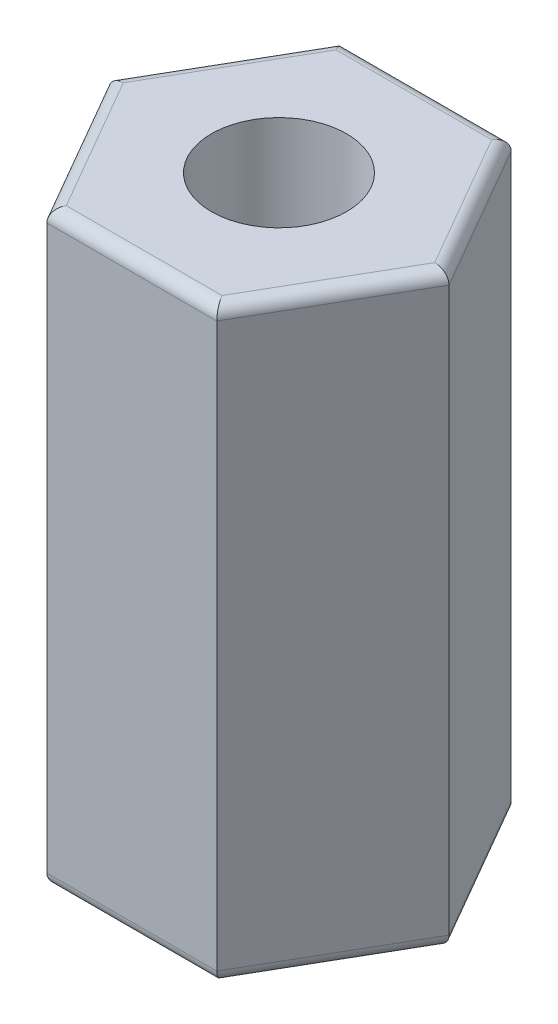
ISO-10303-21;
HEADER;
FILE_DESCRIPTION(('STEP AP214'),'2;1');
FILE_NAME('part.step','',(''),(''),'','','');
FILE_SCHEMA(('AUTOMOTIVE_DESIGN { 1 0 10303 214 1 1 1 1 }'));
ENDSEC;
DATA;
#1=APPLICATION_CONTEXT('core data for automotive mechanical design processes');
#2=APPLICATION_PROTOCOL_DEFINITION('international standard','automotive_design',2000,#1);
#3=PRODUCT_CONTEXT('',#1,'mechanical');
#4=PRODUCT('Part','Part','',(#3));
#5=PRODUCT_RELATED_PRODUCT_CATEGORY('part','',(#4));
#6=PRODUCT_DEFINITION_FORMATION('','',#4);
#7=PRODUCT_DEFINITION_CONTEXT('part definition',#1,'design');
#8=PRODUCT_DEFINITION('design','',#6,#7);
#9=PRODUCT_DEFINITION_SHAPE('','',#8);
#10=(LENGTH_UNIT() NAMED_UNIT(*) SI_UNIT(.MILLI.,.METRE.));
#11=(NAMED_UNIT(*) PLANE_ANGLE_UNIT() SI_UNIT($,.RADIAN.));
#12=(NAMED_UNIT(*) SI_UNIT($,.STERADIAN.) SOLID_ANGLE_UNIT());
#13=UNCERTAINTY_MEASURE_WITH_UNIT(LENGTH_MEASURE(1.E-05),#10,'distance_accuracy_value','');
#14=(GEOMETRIC_REPRESENTATION_CONTEXT(3) GLOBAL_UNCERTAINTY_ASSIGNED_CONTEXT((#13)) GLOBAL_UNIT_ASSIGNED_CONTEXT((#10,
#11,#12)) REPRESENTATION_CONTEXT('',''));
#15=CARTESIAN_POINT('',(0.,0.,0.));
#16=DIRECTION('',(0.,0.,1.));
#17=DIRECTION('',(1.,0.,0.));
#18=AXIS2_PLACEMENT_3D('',#15,#16,#17);
#19=CARTESIAN_POINT('',(1.37409364067131,9.5,2.38));
#20=DIRECTION('',(-0.866025403784439,0.,-0.5));
#21=DIRECTION('',(-0.5,0.,0.866025403784439));
#22=AXIS2_PLACEMENT_3D('',#19,#20,#21);
#23=PLANE('',#22);
#24=DIRECTION('',(0.,-1.,0.));
#25=VECTOR('',#24,1.);
#26=CARTESIAN_POINT('',(2.74818728134262,9.5,0.));
#27=LINE('',#26,#25);
#28=CARTESIAN_POINT('',(2.74818728134262,9.3,0.));
#29=VERTEX_POINT('',#28);
#30=CARTESIAN_POINT('',(2.74818728134262,0.200000000000001,0.));
#31=VERTEX_POINT('',#30);
#32=EDGE_CURVE('E147',#29,#31,#27,.T.);
#33=ORIENTED_EDGE('',*,*,#32,.F.);
#34=DIRECTION('',(0.5,0.,-0.866025403784439));
#35=VECTOR('',#34,1.);
#36=CARTESIAN_POINT('',(1.37409364067131,9.3,2.38));
#37=LINE('',#36,#35);
#38=CARTESIAN_POINT('',(1.37409364067131,9.3,2.38));
#39=VERTEX_POINT('',#38);
#40=EDGE_CURVE('E138',#29,#39,#37,.F.);
#41=ORIENTED_EDGE('',*,*,#40,.T.);
#42=DIRECTION('',(0.,-1.,0.));
#43=VECTOR('',#42,1.);
#44=CARTESIAN_POINT('',(1.37409364067131,9.5,2.38));
#45=LINE('',#44,#43);
#46=CARTESIAN_POINT('',(1.37409364067131,0.200000000000001,2.38));
#47=VERTEX_POINT('',#46);
#48=EDGE_CURVE('E204',#39,#47,#45,.T.);
#49=ORIENTED_EDGE('',*,*,#48,.T.);
#50=DIRECTION('',(0.5,0.,-0.866025403784439));
#51=VECTOR('',#50,1.);
#52=CARTESIAN_POINT('',(1.37409364067131,0.200000000000001,2.38));
#53=LINE('',#52,#51);
#54=EDGE_CURVE('E179',#47,#31,#53,.T.);
#55=ORIENTED_EDGE('',*,*,#54,.T.);
#56=EDGE_LOOP('',(#33,#41,#49,#55));
#57=FACE_BOUND('',#56,.T.);
#58=ADVANCED_FACE('F31',(#57),#23,.F.);
#59=CARTESIAN_POINT('',(2.74818728134262,9.5,0.));
#60=DIRECTION('',(-0.866025403784439,0.,0.5));
#61=DIRECTION('',(0.5,0.,0.866025403784439));
#62=AXIS2_PLACEMENT_3D('',#59,#60,#61);
#63=PLANE('',#62);
#64=DIRECTION('',(0.,-1.,0.));
#65=VECTOR('',#64,1.);
#66=CARTESIAN_POINT('',(1.37409364067131,9.5,-2.38));
#67=LINE('',#66,#65);
#68=CARTESIAN_POINT('',(1.37409364067131,9.3,-2.38));
#69=VERTEX_POINT('',#68);
#70=CARTESIAN_POINT('',(1.37409364067131,0.200000000000001,-2.38));
#71=VERTEX_POINT('',#70);
#72=EDGE_CURVE('E150',#69,#71,#67,.T.);
#73=ORIENTED_EDGE('',*,*,#72,.F.);
#74=DIRECTION('',(-0.5,0.,-0.866025403784439));
#75=VECTOR('',#74,1.);
#76=CARTESIAN_POINT('',(2.74818728134262,9.3,0.));
#77=LINE('',#76,#75);
#78=EDGE_CURVE('E184',#69,#29,#77,.F.);
#79=ORIENTED_EDGE('',*,*,#78,.T.);
#80=ORIENTED_EDGE('',*,*,#32,.T.);
#81=DIRECTION('',(-0.5,0.,-0.866025403784439));
#82=VECTOR('',#81,1.);
#83=CARTESIAN_POINT('',(2.74818728134262,0.200000000000001,0.));
#84=LINE('',#83,#82);
#85=EDGE_CURVE('E182',#31,#71,#84,.T.);
#86=ORIENTED_EDGE('',*,*,#85,.T.);
#87=EDGE_LOOP('',(#73,#79,#80,#86));
#88=FACE_BOUND('',#87,.T.);
#89=ADVANCED_FACE('F265',(#88),#63,.F.);
#90=CARTESIAN_POINT('',(1.37409364067131,9.5,-2.38));
#91=DIRECTION('',(0.,0.,1.));
#92=DIRECTION('',(1.,0.,0.));
#93=AXIS2_PLACEMENT_3D('',#90,#91,#92);
#94=PLANE('',#93);
#95=DIRECTION('',(0.,-1.,0.));
#96=VECTOR('',#95,1.);
#97=CARTESIAN_POINT('',(-1.37409364067131,9.5,-2.38));
#98=LINE('',#97,#96);
#99=CARTESIAN_POINT('',(-1.37409364067131,9.3,-2.38));
#100=VERTEX_POINT('',#99);
#101=CARTESIAN_POINT('',(-1.37409364067131,0.200000000000001,-2.38));
#102=VERTEX_POINT('',#101);
#103=EDGE_CURVE('E256',#100,#102,#98,.T.);
#104=ORIENTED_EDGE('',*,*,#103,.F.);
#105=DIRECTION('',(-1.,0.,0.));
#106=VECTOR('',#105,1.);
#107=CARTESIAN_POINT('',(1.37409364067131,9.3,-2.38));
#108=LINE('',#107,#106);
#109=EDGE_CURVE('E163',#100,#69,#108,.F.);
#110=ORIENTED_EDGE('',*,*,#109,.T.);
#111=ORIENTED_EDGE('',*,*,#72,.T.);
#112=DIRECTION('',(-1.,0.,0.));
#113=VECTOR('',#112,1.);
#114=CARTESIAN_POINT('',(1.37409364067131,0.200000000000001,-2.38));
#115=LINE('',#114,#113);
#116=EDGE_CURVE('E161',#71,#102,#115,.T.);
#117=ORIENTED_EDGE('',*,*,#116,.T.);
#118=EDGE_LOOP('',(#104,#110,#111,#117));
#119=FACE_BOUND('',#118,.T.);
#120=ADVANCED_FACE('F262',(#119),#94,.F.);
#121=CARTESIAN_POINT('',(-1.37409364067131,9.5,-2.38));
#122=DIRECTION('',(0.866025403784439,0.,0.5));
#123=DIRECTION('',(0.5,0.,-0.866025403784439));
#124=AXIS2_PLACEMENT_3D('',#121,#122,#123);
#125=PLANE('',#124);
#126=DIRECTION('',(0.,-1.,0.));
#127=VECTOR('',#126,1.);
#128=CARTESIAN_POINT('',(-2.74818728134262,9.5,0.));
#129=LINE('',#128,#127);
#130=CARTESIAN_POINT('',(-2.74818728134262,9.3,0.));
#131=VERTEX_POINT('',#130);
#132=CARTESIAN_POINT('',(-2.74818728134262,0.200000000000001,0.));
#133=VERTEX_POINT('',#132);
#134=EDGE_CURVE('E249',#131,#133,#129,.T.);
#135=ORIENTED_EDGE('',*,*,#134,.F.);
#136=DIRECTION('',(-0.5,0.,0.866025403784439));
#137=VECTOR('',#136,1.);
#138=CARTESIAN_POINT('',(-1.37409364067131,9.3,-2.38));
#139=LINE('',#138,#137);
#140=EDGE_CURVE('E168',#131,#100,#139,.F.);
#141=ORIENTED_EDGE('',*,*,#140,.T.);
#142=ORIENTED_EDGE('',*,*,#103,.T.);
#143=DIRECTION('',(-0.5,0.,0.866025403784439));
#144=VECTOR('',#143,1.);
#145=CARTESIAN_POINT('',(-1.37409364067131,0.200000000000001,-2.38));
#146=LINE('',#145,#144);
#147=EDGE_CURVE('E166',#102,#133,#146,.T.);
#148=ORIENTED_EDGE('',*,*,#147,.T.);
#149=EDGE_LOOP('',(#135,#141,#142,#148));
#150=FACE_BOUND('',#149,.T.);
#151=ADVANCED_FACE('F272',(#150),#125,.F.);
#152=CARTESIAN_POINT('',(-2.74818728134262,9.5,0.));
#153=DIRECTION('',(0.866025403784439,0.,-0.5));
#154=DIRECTION('',(-0.5,0.,-0.866025403784439));
#155=AXIS2_PLACEMENT_3D('',#152,#153,#154);
#156=PLANE('',#155);
#157=DIRECTION('',(0.,-1.,0.));
#158=VECTOR('',#157,1.);
#159=CARTESIAN_POINT('',(-1.37409364067131,9.5,2.38));
#160=LINE('',#159,#158);
#161=CARTESIAN_POINT('',(-1.37409364067131,9.3,2.38));
#162=VERTEX_POINT('',#161);
#163=CARTESIAN_POINT('',(-1.37409364067131,0.200000000000001,2.38));
#164=VERTEX_POINT('',#163);
#165=EDGE_CURVE('E245',#162,#164,#160,.T.);
#166=ORIENTED_EDGE('',*,*,#165,.F.);
#167=DIRECTION('',(0.5,0.,0.866025403784439));
#168=VECTOR('',#167,1.);
#169=CARTESIAN_POINT('',(-2.74818728134262,9.3,0.));
#170=LINE('',#169,#168);
#171=EDGE_CURVE('E172',#162,#131,#170,.F.);
#172=ORIENTED_EDGE('',*,*,#171,.T.);
#173=ORIENTED_EDGE('',*,*,#134,.T.);
#174=DIRECTION('',(0.5,0.,0.866025403784439));
#175=VECTOR('',#174,1.);
#176=CARTESIAN_POINT('',(-2.74818728134262,0.200000000000001,0.));
#177=LINE('',#176,#175);
#178=EDGE_CURVE('E170',#133,#164,#177,.T.);
#179=ORIENTED_EDGE('',*,*,#178,.T.);
#180=EDGE_LOOP('',(#166,#172,#173,#179));
#181=FACE_BOUND('',#180,.T.);
#182=ADVANCED_FACE('F359',(#181),#156,.F.);
#183=CARTESIAN_POINT('',(-1.37409364067131,9.5,2.38));
#184=DIRECTION('',(0.,0.,-1.));
#185=DIRECTION('',(-1.,0.,0.));
#186=AXIS2_PLACEMENT_3D('',#183,#184,#185);
#187=PLANE('',#186);
#188=ORIENTED_EDGE('',*,*,#48,.F.);
#189=DIRECTION('',(1.,0.,0.));
#190=VECTOR('',#189,1.);
#191=CARTESIAN_POINT('',(-1.37409364067131,9.3,2.38));
#192=LINE('',#191,#190);
#193=EDGE_CURVE('E177',#39,#162,#192,.F.);
#194=ORIENTED_EDGE('',*,*,#193,.T.);
#195=ORIENTED_EDGE('',*,*,#165,.T.);
#196=DIRECTION('',(1.,0.,0.));
#197=VECTOR('',#196,1.);
#198=CARTESIAN_POINT('',(-1.37409364067131,0.200000000000001,2.38));
#199=LINE('',#198,#197);
#200=EDGE_CURVE('E174',#164,#47,#199,.T.);
#201=ORIENTED_EDGE('',*,*,#200,.T.);
#202=EDGE_LOOP('',(#188,#194,#195,#201));
#203=FACE_BOUND('',#202,.T.);
#204=ADVANCED_FACE('F242',(#203),#187,.F.);
#205=CARTESIAN_POINT('',(2.74818728134262,9.5,0.));
#206=DIRECTION('',(0.,1.,0.));
#207=DIRECTION('',(0.,0.,1.));
#208=AXIS2_PLACEMENT_3D('',#205,#206,#207);
#209=PLANE('',#208);
#210=CARTESIAN_POINT('',(0.,9.5,0.));
#211=DIRECTION('',(0.,1.,0.));
#212=DIRECTION('',(0.,0.,1.));
#213=AXIS2_PLACEMENT_3D('',#210,#211,#212);
#214=CIRCLE('',#213,1.0922);
#215=CARTESIAN_POINT('',(0.,9.5,1.0922));
#216=VERTEX_POINT('',#215);
#217=EDGE_CURVE('E207',#216,#216,#214,.T.);
#218=ORIENTED_EDGE('',*,*,#217,.F.);
#219=EDGE_LOOP('',(#218));
#220=FACE_BOUND('',#219,.T.);
#221=DIRECTION('',(-0.5,0.,-0.866025403784439));
#222=VECTOR('',#221,1.);
#223=CARTESIAN_POINT('',(1.20088855991442,9.5,-2.28));
#224=LINE('',#223,#222);
#225=CARTESIAN_POINT('',(2.51724717366677,9.5,0.));
#226=VERTEX_POINT('',#225);
#227=CARTESIAN_POINT('',(1.25862358683338,9.5,-2.18));
#228=VERTEX_POINT('',#227);
#229=EDGE_CURVE('E126',#226,#228,#224,.T.);
#230=ORIENTED_EDGE('',*,*,#229,.T.);
#231=DIRECTION('',(-1.,0.,0.));
#232=VECTOR('',#231,1.);
#233=CARTESIAN_POINT('',(-1.37409364067131,9.5,-2.18));
#234=LINE('',#233,#232);
#235=CARTESIAN_POINT('',(-1.25862358683338,9.5,-2.18));
#236=VERTEX_POINT('',#235);
#237=EDGE_CURVE('E159',#228,#236,#234,.T.);
#238=ORIENTED_EDGE('',*,*,#237,.T.);
#239=DIRECTION('',(-0.5,0.,0.866025403784439));
#240=VECTOR('',#239,1.);
#241=CARTESIAN_POINT('',(-2.57498220058573,9.5,0.100000000000001));
#242=LINE('',#241,#240);
#243=CARTESIAN_POINT('',(-2.51724717366677,9.5,0.));
#244=VERTEX_POINT('',#243);
#245=EDGE_CURVE('E157',#236,#244,#242,.T.);
#246=ORIENTED_EDGE('',*,*,#245,.T.);
#247=DIRECTION('',(0.5,0.,0.866025403784439));
#248=VECTOR('',#247,1.);
#249=CARTESIAN_POINT('',(-1.20088855991442,9.5,2.28));
#250=LINE('',#249,#248);
#251=CARTESIAN_POINT('',(-1.25862358683339,9.5,2.18));
#252=VERTEX_POINT('',#251);
#253=EDGE_CURVE('E155',#244,#252,#250,.T.);
#254=ORIENTED_EDGE('',*,*,#253,.T.);
#255=DIRECTION('',(1.,0.,0.));
#256=VECTOR('',#255,1.);
#257=CARTESIAN_POINT('',(1.37409364067131,9.5,2.18));
#258=LINE('',#257,#256);
#259=CARTESIAN_POINT('',(1.25862358683338,9.5,2.18));
#260=VERTEX_POINT('',#259);
#261=EDGE_CURVE('E129',#252,#260,#258,.T.);
#262=ORIENTED_EDGE('',*,*,#261,.T.);
#263=DIRECTION('',(0.5,0.,-0.866025403784439));
#264=VECTOR('',#263,1.);
#265=CARTESIAN_POINT('',(2.57498220058573,9.5,-0.1));
#266=LINE('',#265,#264);
#267=EDGE_CURVE('E121',#260,#226,#266,.T.);
#268=ORIENTED_EDGE('',*,*,#267,.T.);
#269=EDGE_LOOP('',(#230,#238,#246,#254,#262,#268));
#270=FACE_BOUND('',#269,.T.);
#271=ADVANCED_FACE('F123',(#220,#270),#209,.T.);
#272=CARTESIAN_POINT('',(2.74818728134262,0.,0.));
#273=DIRECTION('',(0.,1.,0.));
#274=DIRECTION('',(0.,0.,1.));
#275=AXIS2_PLACEMENT_3D('',#272,#273,#274);
#276=PLANE('',#275);
#277=CARTESIAN_POINT('',(0.,0.,0.));
#278=DIRECTION('',(0.,-1.,0.));
#279=DIRECTION('',(0.,0.,-1.));
#280=AXIS2_PLACEMENT_3D('',#277,#278,#279);
#281=CIRCLE('',#280,1.0922);
#282=CARTESIAN_POINT('',(0.,0.,-1.0922));
#283=VERTEX_POINT('',#282);
#284=EDGE_CURVE('E458',#283,#283,#281,.T.);
#285=ORIENTED_EDGE('',*,*,#284,.F.);
#286=EDGE_LOOP('',(#285));
#287=FACE_BOUND('',#286,.T.);
#288=DIRECTION('',(0.5,0.,-0.866025403784439));
#289=VECTOR('',#288,1.);
#290=CARTESIAN_POINT('',(2.57498220058573,0.,-0.1));
#291=LINE('',#290,#289);
#292=CARTESIAN_POINT('',(2.51724717366677,0.,0.));
#293=VERTEX_POINT('',#292);
#294=CARTESIAN_POINT('',(1.25862358683338,0.,2.18));
#295=VERTEX_POINT('',#294);
#296=EDGE_CURVE('E186',#293,#295,#291,.F.);
#297=ORIENTED_EDGE('',*,*,#296,.T.);
#298=DIRECTION('',(1.,0.,0.));
#299=VECTOR('',#298,1.);
#300=CARTESIAN_POINT('',(2.74818728134262,0.,2.18));
#301=LINE('',#300,#299);
#302=CARTESIAN_POINT('',(-1.25862358683339,0.,2.18));
#303=VERTEX_POINT('',#302);
#304=EDGE_CURVE('E11',#295,#303,#301,.F.);
#305=ORIENTED_EDGE('',*,*,#304,.T.);
#306=DIRECTION('',(0.5,0.,0.866025403784439));
#307=VECTOR('',#306,1.);
#308=CARTESIAN_POINT('',(-1.20088855991442,0.,2.28));
#309=LINE('',#308,#307);
#310=CARTESIAN_POINT('',(-2.51724717366677,0.,0.));
#311=VERTEX_POINT('',#310);
#312=EDGE_CURVE('E40',#303,#311,#309,.F.);
#313=ORIENTED_EDGE('',*,*,#312,.T.);
#314=DIRECTION('',(-0.5,0.,0.866025403784439));
#315=VECTOR('',#314,1.);
#316=CARTESIAN_POINT('',(-1.20088855991442,0.,-2.28));
#317=LINE('',#316,#315);
#318=CARTESIAN_POINT('',(-1.25862358683338,0.,-2.18));
#319=VERTEX_POINT('',#318);
#320=EDGE_CURVE('E192',#311,#319,#317,.F.);
#321=ORIENTED_EDGE('',*,*,#320,.T.);
#322=DIRECTION('',(-1.,0.,0.));
#323=VECTOR('',#322,1.);
#324=CARTESIAN_POINT('',(2.74818728134262,0.,-2.18));
#325=LINE('',#324,#323);
#326=CARTESIAN_POINT('',(1.25862358683338,0.,-2.18));
#327=VERTEX_POINT('',#326);
#328=EDGE_CURVE('E190',#319,#327,#325,.F.);
#329=ORIENTED_EDGE('',*,*,#328,.T.);
#330=DIRECTION('',(-0.5,0.,-0.866025403784439));
#331=VECTOR('',#330,1.);
#332=CARTESIAN_POINT('',(2.57498220058573,0.,0.1));
#333=LINE('',#332,#331);
#334=EDGE_CURVE('E188',#327,#293,#333,.F.);
#335=ORIENTED_EDGE('',*,*,#334,.T.);
#336=EDGE_LOOP('',(#297,#305,#313,#321,#329,#335));
#337=FACE_BOUND('',#336,.T.);
#338=ADVANCED_FACE('F229',(#287,#337),#276,.F.);
#339=CARTESIAN_POINT('',(2.74818728134262,9.3,2.18));
#340=DIRECTION('',(-1.,0.,0.));
#341=DIRECTION('',(0.,0.,1.));
#342=AXIS2_PLACEMENT_3D('',#339,#340,#341);
#343=CYLINDRICAL_SURFACE('',#342,0.2);
#344=CARTESIAN_POINT('',(-1.25862358683339,9.3,2.18));
#345=DIRECTION('',(-0.866025403784439,0.,-0.5));
#346=DIRECTION('',(-0.5,0.,0.866025403784439));
#347=AXIS2_PLACEMENT_3D('',#344,#345,#346);
#348=ELLIPSE('',#347,0.23094010767585,0.2);
#349=EDGE_CURVE('E141',#162,#252,#348,.T.);
#350=ORIENTED_EDGE('',*,*,#349,.F.);
#351=ORIENTED_EDGE('',*,*,#193,.F.);
#352=CARTESIAN_POINT('',(1.25862358683338,9.3,2.18));
#353=DIRECTION('',(-0.866025403784438,0.,0.5));
#354=DIRECTION('',(0.5,0.,0.866025403784439));
#355=AXIS2_PLACEMENT_3D('',#352,#353,#354);
#356=ELLIPSE('',#355,0.23094010767585,0.2);
#357=EDGE_CURVE('E202',#260,#39,#356,.F.);
#358=ORIENTED_EDGE('',*,*,#357,.F.);
#359=ORIENTED_EDGE('',*,*,#261,.F.);
#360=EDGE_LOOP('',(#350,#351,#358,#359));
#361=FACE_BOUND('',#360,.T.);
#362=ADVANCED_FACE('F293',(#361),#343,.T.);
#363=CARTESIAN_POINT('',(2.57498220058573,9.3,-0.1));
#364=DIRECTION('',(-0.5,0.,0.866025403784439));
#365=DIRECTION('',(0.866025403784439,0.,0.5));
#366=AXIS2_PLACEMENT_3D('',#363,#364,#365);
#367=CYLINDRICAL_SURFACE('',#366,0.2);
#368=ORIENTED_EDGE('',*,*,#357,.T.);
#369=ORIENTED_EDGE('',*,*,#40,.F.);
#370=CARTESIAN_POINT('',(2.51724717366677,9.3,0.));
#371=DIRECTION('',(0.,0.,1.));
#372=DIRECTION('',(1.,0.,0.));
#373=AXIS2_PLACEMENT_3D('',#370,#371,#372);
#374=ELLIPSE('',#373,0.23094010767585,0.2);
#375=EDGE_CURVE('E136',#226,#29,#374,.F.);
#376=ORIENTED_EDGE('',*,*,#375,.F.);
#377=ORIENTED_EDGE('',*,*,#267,.F.);
#378=EDGE_LOOP('',(#368,#369,#376,#377));
#379=FACE_BOUND('',#378,.T.);
#380=ADVANCED_FACE('F137',(#379),#367,.T.);
#381=CARTESIAN_POINT('',(-1.20088855991442,9.3,2.28));
#382=DIRECTION('',(-0.5,0.,-0.866025403784439));
#383=DIRECTION('',(-0.866025403784439,0.,0.5));
#384=AXIS2_PLACEMENT_3D('',#381,#382,#383);
#385=CYLINDRICAL_SURFACE('',#384,0.2);
#386=ORIENTED_EDGE('',*,*,#349,.T.);
#387=ORIENTED_EDGE('',*,*,#253,.F.);
#388=CARTESIAN_POINT('',(-2.51724717366677,9.3,0.));
#389=DIRECTION('',(0.,0.,-1.));
#390=DIRECTION('',(-1.,0.,0.));
#391=AXIS2_PLACEMENT_3D('',#388,#389,#390);
#392=ELLIPSE('',#391,0.23094010767585,0.2);
#393=EDGE_CURVE('E142',#131,#244,#392,.T.);
#394=ORIENTED_EDGE('',*,*,#393,.F.);
#395=ORIENTED_EDGE('',*,*,#171,.F.);
#396=EDGE_LOOP('',(#386,#387,#394,#395));
#397=FACE_BOUND('',#396,.T.);
#398=ADVANCED_FACE('F287',(#397),#385,.T.);
#399=CARTESIAN_POINT('',(2.57498220058573,9.3,0.1));
#400=DIRECTION('',(0.5,0.,0.866025403784439));
#401=DIRECTION('',(0.866025403784439,0.,-0.5));
#402=AXIS2_PLACEMENT_3D('',#399,#400,#401);
#403=CYLINDRICAL_SURFACE('',#402,0.2);
#404=ORIENTED_EDGE('',*,*,#375,.T.);
#405=ORIENTED_EDGE('',*,*,#78,.F.);
#406=CARTESIAN_POINT('',(1.25862358683338,9.3,-2.18));
#407=DIRECTION('',(0.866025403784439,0.,0.5));
#408=DIRECTION('',(-0.5,0.,0.866025403784439));
#409=AXIS2_PLACEMENT_3D('',#406,#407,#408);
#410=ELLIPSE('',#409,0.23094010767585,0.2);
#411=EDGE_CURVE('E145',#228,#69,#410,.F.);
#412=ORIENTED_EDGE('',*,*,#411,.F.);
#413=ORIENTED_EDGE('',*,*,#229,.F.);
#414=EDGE_LOOP('',(#404,#405,#412,#413));
#415=FACE_BOUND('',#414,.T.);
#416=ADVANCED_FACE('F144',(#415),#403,.T.);
#417=CARTESIAN_POINT('',(-1.20088855991442,9.3,-2.28));
#418=DIRECTION('',(0.5,0.,-0.866025403784439));
#419=DIRECTION('',(-0.866025403784439,0.,-0.5));
#420=AXIS2_PLACEMENT_3D('',#417,#418,#419);
#421=CYLINDRICAL_SURFACE('',#420,0.2);
#422=ORIENTED_EDGE('',*,*,#393,.T.);
#423=ORIENTED_EDGE('',*,*,#245,.F.);
#424=CARTESIAN_POINT('',(-1.25862358683338,9.3,-2.18));
#425=DIRECTION('',(0.866025403784439,0.,-0.5));
#426=DIRECTION('',(-0.5,0.,-0.866025403784438));
#427=AXIS2_PLACEMENT_3D('',#424,#425,#426);
#428=ELLIPSE('',#427,0.23094010767585,0.2);
#429=EDGE_CURVE('E195',#100,#236,#428,.T.);
#430=ORIENTED_EDGE('',*,*,#429,.F.);
#431=ORIENTED_EDGE('',*,*,#140,.F.);
#432=EDGE_LOOP('',(#422,#423,#430,#431));
#433=FACE_BOUND('',#432,.T.);
#434=ADVANCED_FACE('F280',(#433),#421,.T.);
#435=CARTESIAN_POINT('',(2.74818728134262,9.3,-2.18));
#436=DIRECTION('',(1.,0.,0.));
#437=DIRECTION('',(0.,0.,-1.));
#438=AXIS2_PLACEMENT_3D('',#435,#436,#437);
#439=CYLINDRICAL_SURFACE('',#438,0.2);
#440=ORIENTED_EDGE('',*,*,#411,.T.);
#441=ORIENTED_EDGE('',*,*,#109,.F.);
#442=ORIENTED_EDGE('',*,*,#429,.T.);
#443=ORIENTED_EDGE('',*,*,#237,.F.);
#444=EDGE_LOOP('',(#440,#441,#442,#443));
#445=FACE_BOUND('',#444,.T.);
#446=ADVANCED_FACE('F277',(#445),#439,.T.);
#447=CARTESIAN_POINT('',(1.37409364067131,0.200000000000001,-2.18));
#448=DIRECTION('',(-1.,0.,0.));
#449=DIRECTION('',(0.,0.,1.));
#450=AXIS2_PLACEMENT_3D('',#447,#448,#449);
#451=CYLINDRICAL_SURFACE('',#450,0.2);
#452=CARTESIAN_POINT('',(1.25862358683338,0.200000000000001,-2.18));
#453=DIRECTION('',(-0.866025403784439,0.,-0.5));
#454=DIRECTION('',(0.5,0.,-0.866025403784439));
#455=AXIS2_PLACEMENT_3D('',#452,#453,#454);
#456=ELLIPSE('',#455,0.23094010767585,0.2);
#457=EDGE_CURVE('E214',#327,#71,#456,.F.);
#458=ORIENTED_EDGE('',*,*,#457,.F.);
#459=ORIENTED_EDGE('',*,*,#328,.F.);
#460=CARTESIAN_POINT('',(-1.25862358683338,0.200000000000001,-2.18));
#461=DIRECTION('',(-0.866025403784439,0.,0.5));
#462=DIRECTION('',(-0.5,0.,-0.866025403784438));
#463=AXIS2_PLACEMENT_3D('',#460,#461,#462);
#464=ELLIPSE('',#463,0.23094010767585,0.2);
#465=EDGE_CURVE('E35',#102,#319,#464,.T.);
#466=ORIENTED_EDGE('',*,*,#465,.F.);
#467=ORIENTED_EDGE('',*,*,#116,.F.);
#468=EDGE_LOOP('',(#458,#459,#466,#467));
#469=FACE_BOUND('',#468,.T.);
#470=ADVANCED_FACE('F33',(#469),#451,.T.);
#471=CARTESIAN_POINT('',(-1.20088855991442,0.200000000000001,-2.28));
#472=DIRECTION('',(-0.5,0.,0.866025403784439));
#473=DIRECTION('',(0.866025403784439,0.,0.5));
#474=AXIS2_PLACEMENT_3D('',#471,#472,#473);
#475=CYLINDRICAL_SURFACE('',#474,0.2);
#476=ORIENTED_EDGE('',*,*,#465,.T.);
#477=ORIENTED_EDGE('',*,*,#320,.F.);
#478=CARTESIAN_POINT('',(-2.51724717366677,0.200000000000001,0.));
#479=DIRECTION('',(0.,0.,1.));
#480=DIRECTION('',(-1.,0.,0.));
#481=AXIS2_PLACEMENT_3D('',#478,#479,#480);
#482=ELLIPSE('',#481,0.23094010767585,0.2);
#483=EDGE_CURVE('E212',#133,#311,#482,.T.);
#484=ORIENTED_EDGE('',*,*,#483,.F.);
#485=ORIENTED_EDGE('',*,*,#147,.F.);
#486=EDGE_LOOP('',(#476,#477,#484,#485));
#487=FACE_BOUND('',#486,.T.);
#488=ADVANCED_FACE('F224',(#487),#475,.T.);
#489=CARTESIAN_POINT('',(2.57498220058573,0.200000000000001,0.1));
#490=DIRECTION('',(-0.5,0.,-0.866025403784439));
#491=DIRECTION('',(-0.866025403784439,0.,0.5));
#492=AXIS2_PLACEMENT_3D('',#489,#490,#491);
#493=CYLINDRICAL_SURFACE('',#492,0.2);
#494=ORIENTED_EDGE('',*,*,#457,.T.);
#495=ORIENTED_EDGE('',*,*,#85,.F.);
#496=CARTESIAN_POINT('',(2.51724717366677,0.200000000000001,0.));
#497=DIRECTION('',(0.,0.,-1.));
#498=DIRECTION('',(1.,0.,0.));
#499=AXIS2_PLACEMENT_3D('',#496,#497,#498);
#500=ELLIPSE('',#499,0.23094010767585,0.2);
#501=EDGE_CURVE('E209',#293,#31,#500,.F.);
#502=ORIENTED_EDGE('',*,*,#501,.F.);
#503=ORIENTED_EDGE('',*,*,#334,.F.);
#504=EDGE_LOOP('',(#494,#495,#502,#503));
#505=FACE_BOUND('',#504,.T.);
#506=ADVANCED_FACE('F232',(#505),#493,.T.);
#507=CARTESIAN_POINT('',(-2.57498220058573,0.200000000000001,-0.0999999999999992));
#508=DIRECTION('',(0.5,0.,0.866025403784439));
#509=DIRECTION('',(0.866025403784439,0.,-0.5));
#510=AXIS2_PLACEMENT_3D('',#507,#508,#509);
#511=CYLINDRICAL_SURFACE('',#510,0.2);
#512=ORIENTED_EDGE('',*,*,#483,.T.);
#513=ORIENTED_EDGE('',*,*,#312,.F.);
#514=CARTESIAN_POINT('',(-1.25862358683339,0.200000000000001,2.18));
#515=DIRECTION('',(0.866025403784439,0.,0.5));
#516=DIRECTION('',(-0.5,0.,0.866025403784439));
#517=AXIS2_PLACEMENT_3D('',#514,#515,#516);
#518=ELLIPSE('',#517,0.23094010767585,0.2);
#519=EDGE_CURVE('E48',#164,#303,#518,.T.);
#520=ORIENTED_EDGE('',*,*,#519,.F.);
#521=ORIENTED_EDGE('',*,*,#178,.F.);
#522=EDGE_LOOP('',(#512,#513,#520,#521));
#523=FACE_BOUND('',#522,.T.);
#524=ADVANCED_FACE('F302',(#523),#511,.T.);
#525=CARTESIAN_POINT('',(1.20088855991442,0.200000000000001,2.28));
#526=DIRECTION('',(0.5,0.,-0.866025403784439));
#527=DIRECTION('',(-0.866025403784439,0.,-0.5));
#528=AXIS2_PLACEMENT_3D('',#525,#526,#527);
#529=CYLINDRICAL_SURFACE('',#528,0.2);
#530=ORIENTED_EDGE('',*,*,#501,.T.);
#531=ORIENTED_EDGE('',*,*,#54,.F.);
#532=CARTESIAN_POINT('',(1.25862358683338,0.200000000000001,2.18));
#533=DIRECTION('',(0.866025403784438,0.,-0.5));
#534=DIRECTION('',(-0.5,0.,-0.866025403784439));
#535=AXIS2_PLACEMENT_3D('',#532,#533,#534);
#536=ELLIPSE('',#535,0.23094010767585,0.2);
#537=EDGE_CURVE('E205',#295,#47,#536,.F.);
#538=ORIENTED_EDGE('',*,*,#537,.F.);
#539=ORIENTED_EDGE('',*,*,#296,.F.);
#540=EDGE_LOOP('',(#530,#531,#538,#539));
#541=FACE_BOUND('',#540,.T.);
#542=ADVANCED_FACE('F236',(#541),#529,.T.);
#543=CARTESIAN_POINT('',(-1.37409364067131,0.200000000000001,2.18));
#544=DIRECTION('',(1.,0.,0.));
#545=DIRECTION('',(0.,0.,-1.));
#546=AXIS2_PLACEMENT_3D('',#543,#544,#545);
#547=CYLINDRICAL_SURFACE('',#546,0.2);
#548=ORIENTED_EDGE('',*,*,#519,.T.);
#549=ORIENTED_EDGE('',*,*,#304,.F.);
#550=ORIENTED_EDGE('',*,*,#537,.T.);
#551=ORIENTED_EDGE('',*,*,#200,.F.);
#552=EDGE_LOOP('',(#548,#549,#550,#551));
#553=FACE_BOUND('',#552,.T.);
#554=ADVANCED_FACE('F237',(#553),#547,.T.);
#555=CARTESIAN_POINT('',(0.,4.74,0.));
#556=DIRECTION('',(0.,1.,0.));
#557=DIRECTION('',(0.,0.,1.));
#558=AXIS2_PLACEMENT_3D('',#555,#556,#557);
#559=CYLINDRICAL_SURFACE('',#558,1.0922);
#560=ORIENTED_EDGE('',*,*,#217,.T.);
#561=EDGE_LOOP('',(#560));
#562=FACE_BOUND('',#561,.T.);
#563=ORIENTED_EDGE('',*,*,#284,.T.);
#564=EDGE_LOOP('',(#563));
#565=FACE_BOUND('',#564,.T.);
#566=ADVANCED_FACE('F299',(#562,#565),#559,.F.);
#567=CLOSED_SHELL('',(#58,#89,#120,#151,#182,#204,#271,#338,#362,#380,#398,#416,#434,#446,#470,
#488,#506,#524,#542,#554,#566));
#568=MANIFOLD_SOLID_BREP('B2',#567);
#569=ADVANCED_BREP_SHAPE_REPRESENTATION('',(#18,#568),#14);
#570=SHAPE_DEFINITION_REPRESENTATION(#9,#569);
ENDSEC;
END-ISO-10303-21;
